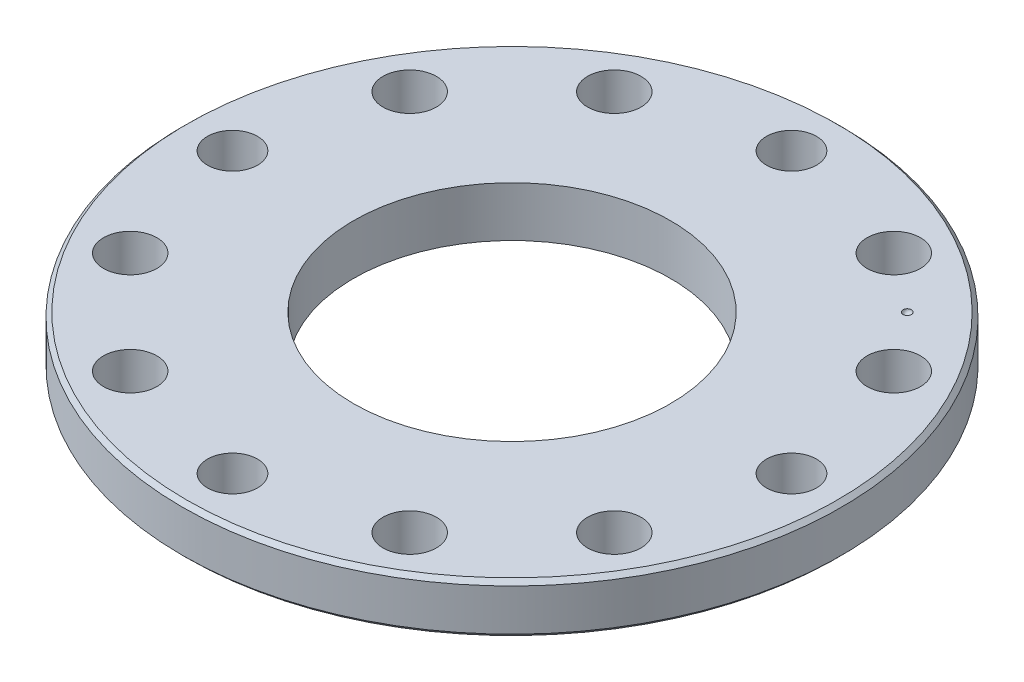
ISO-10303-21;
HEADER;
FILE_DESCRIPTION(('STEP AP214'),'2;1');
FILE_NAME('part.step','',(''),(''),'','','');
FILE_SCHEMA(('AUTOMOTIVE_DESIGN { 1 0 10303 214 1 1 1 1 }'));
ENDSEC;
DATA;
#1=APPLICATION_CONTEXT('core data for automotive mechanical design processes');
#2=APPLICATION_PROTOCOL_DEFINITION('international standard','automotive_design',2000,#1);
#3=PRODUCT_CONTEXT('',#1,'mechanical');
#4=PRODUCT('Part','Part','',(#3));
#5=PRODUCT_RELATED_PRODUCT_CATEGORY('part','',(#4));
#6=PRODUCT_DEFINITION_FORMATION('','',#4);
#7=PRODUCT_DEFINITION_CONTEXT('part definition',#1,'design');
#8=PRODUCT_DEFINITION('design','',#6,#7);
#9=PRODUCT_DEFINITION_SHAPE('','',#8);
#10=(LENGTH_UNIT() NAMED_UNIT(*) SI_UNIT(.MILLI.,.METRE.));
#11=(NAMED_UNIT(*) PLANE_ANGLE_UNIT() SI_UNIT($,.RADIAN.));
#12=(NAMED_UNIT(*) SI_UNIT($,.STERADIAN.) SOLID_ANGLE_UNIT());
#13=UNCERTAINTY_MEASURE_WITH_UNIT(LENGTH_MEASURE(1.E-05),#10,'distance_accuracy_value','');
#14=(GEOMETRIC_REPRESENTATION_CONTEXT(3) GLOBAL_UNCERTAINTY_ASSIGNED_CONTEXT((#13)) GLOBAL_UNIT_ASSIGNED_CONTEXT((#10,
#11,#12)) REPRESENTATION_CONTEXT('',''));
#15=CARTESIAN_POINT('',(0.,0.,0.));
#16=DIRECTION('',(0.,0.,1.));
#17=DIRECTION('',(1.,0.,0.));
#18=AXIS2_PLACEMENT_3D('',#15,#16,#17);
#19=CARTESIAN_POINT('',(0.,-6.,0.));
#20=DIRECTION('',(0.,1.,0.));
#21=DIRECTION('',(0.,0.,1.));
#22=AXIS2_PLACEMENT_3D('',#19,#20,#21);
#23=CYLINDRICAL_SURFACE('',#22,39.5);
#24=CARTESIAN_POINT('',(0.,-0.49999999999998,0.));
#25=DIRECTION('',(0.,1.,0.));
#26=DIRECTION('',(0.,0.,1.));
#27=AXIS2_PLACEMENT_3D('',#24,#25,#26);
#28=CIRCLE('',#27,39.5);
#29=CARTESIAN_POINT('',(0.,-0.49999999999998,39.5));
#30=VERTEX_POINT('',#29);
#31=EDGE_CURVE('E44',#30,#30,#28,.F.);
#32=ORIENTED_EDGE('',*,*,#31,.T.);
#33=EDGE_LOOP('',(#32));
#34=FACE_BOUND('',#33,.T.);
#35=CARTESIAN_POINT('',(0.,-5.49999999999999,0.));
#36=DIRECTION('',(0.,1.,0.));
#37=DIRECTION('',(0.,0.,1.));
#38=AXIS2_PLACEMENT_3D('',#35,#36,#37);
#39=CIRCLE('',#38,39.5);
#40=CARTESIAN_POINT('',(0.,-5.49999999999999,39.5));
#41=VERTEX_POINT('',#40);
#42=EDGE_CURVE('E49',#41,#41,#39,.T.);
#43=ORIENTED_EDGE('',*,*,#42,.T.);
#44=EDGE_LOOP('',(#43));
#45=FACE_BOUND('',#44,.T.);
#46=ADVANCED_FACE('F36',(#34,#45),#23,.T.);
#47=CARTESIAN_POINT('',(0.,-6.,0.));
#48=DIRECTION('',(0.,1.,0.));
#49=DIRECTION('',(0.,0.,1.));
#50=AXIS2_PLACEMENT_3D('',#47,#48,#49);
#51=PLANE('',#50);
#52=CARTESIAN_POINT('',(0.,-6.,0.));
#53=DIRECTION('',(0.,1.,0.));
#54=DIRECTION('',(0.,0.,1.));
#55=AXIS2_PLACEMENT_3D('',#52,#53,#54);
#56=CIRCLE('',#55,39.);
#57=CARTESIAN_POINT('',(0.,-6.,39.));
#58=VERTEX_POINT('',#57);
#59=EDGE_CURVE('E10',#58,#58,#56,.F.);
#60=ORIENTED_EDGE('',*,*,#59,.T.);
#61=EDGE_LOOP('',(#60));
#62=FACE_BOUND('',#61,.T.);
#63=CARTESIAN_POINT('',(-16.75,-6.,29.0118510267787));
#64=DIRECTION('',(0.,1.,0.));
#65=DIRECTION('',(0.,0.,1.));
#66=AXIS2_PLACEMENT_3D('',#63,#64,#65);
#67=CIRCLE('',#66,3.2);
#68=CARTESIAN_POINT('',(-16.75,-6.,32.2118510267787));
#69=VERTEX_POINT('',#68);
#70=EDGE_CURVE('E146',#69,#69,#67,.T.);
#71=ORIENTED_EDGE('',*,*,#70,.T.);
#72=EDGE_LOOP('',(#71));
#73=FACE_BOUND('',#72,.T.);
#74=CARTESIAN_POINT('',(-29.0118510267787,-6.,-16.75));
#75=DIRECTION('',(0.,1.,0.));
#76=DIRECTION('',(0.,0.,1.));
#77=AXIS2_PLACEMENT_3D('',#74,#75,#76);
#78=CIRCLE('',#77,3.2);
#79=CARTESIAN_POINT('',(-29.0118510267787,-6.,-13.55));
#80=VERTEX_POINT('',#79);
#81=EDGE_CURVE('E139',#80,#80,#78,.T.);
#82=ORIENTED_EDGE('',*,*,#81,.T.);
#83=EDGE_LOOP('',(#82));
#84=FACE_BOUND('',#83,.T.);
#85=CARTESIAN_POINT('',(16.75,-6.,-29.0118510267787));
#86=DIRECTION('',(0.,1.,0.));
#87=DIRECTION('',(0.,0.,1.));
#88=AXIS2_PLACEMENT_3D('',#85,#86,#87);
#89=CIRCLE('',#88,3.2);
#90=CARTESIAN_POINT('',(16.75,-6.,-25.8118510267787));
#91=VERTEX_POINT('',#90);
#92=EDGE_CURVE('E132',#91,#91,#89,.T.);
#93=ORIENTED_EDGE('',*,*,#92,.T.);
#94=EDGE_LOOP('',(#93));
#95=FACE_BOUND('',#94,.T.);
#96=CARTESIAN_POINT('',(29.0118510267787,-6.,16.75));
#97=DIRECTION('',(0.,1.,0.));
#98=DIRECTION('',(0.,0.,1.));
#99=AXIS2_PLACEMENT_3D('',#96,#97,#98);
#100=CIRCLE('',#99,3.2);
#101=CARTESIAN_POINT('',(29.0118510267787,-6.,19.95));
#102=VERTEX_POINT('',#101);
#103=EDGE_CURVE('E125',#102,#102,#100,.T.);
#104=ORIENTED_EDGE('',*,*,#103,.T.);
#105=EDGE_LOOP('',(#104));
#106=FACE_BOUND('',#105,.T.);
#107=CARTESIAN_POINT('',(-16.75,-6.,-29.0118510267787));
#108=DIRECTION('',(0.,1.,0.));
#109=DIRECTION('',(0.,0.,1.));
#110=AXIS2_PLACEMENT_3D('',#107,#108,#109);
#111=CIRCLE('',#110,3.2);
#112=CARTESIAN_POINT('',(-16.75,-6.,-25.8118510267787));
#113=VERTEX_POINT('',#112);
#114=EDGE_CURVE('E118',#113,#113,#111,.T.);
#115=ORIENTED_EDGE('',*,*,#114,.T.);
#116=EDGE_LOOP('',(#115));
#117=FACE_BOUND('',#116,.T.);
#118=CARTESIAN_POINT('',(29.0118510267787,-6.,-16.75));
#119=DIRECTION('',(0.,1.,0.));
#120=DIRECTION('',(0.,0.,1.));
#121=AXIS2_PLACEMENT_3D('',#118,#119,#120);
#122=CIRCLE('',#121,3.2);
#123=CARTESIAN_POINT('',(29.0118510267787,-6.,-13.55));
#124=VERTEX_POINT('',#123);
#125=EDGE_CURVE('E112',#124,#124,#122,.T.);
#126=ORIENTED_EDGE('',*,*,#125,.T.);
#127=EDGE_LOOP('',(#126));
#128=FACE_BOUND('',#127,.T.);
#129=CARTESIAN_POINT('',(16.75,-6.,29.0118510267787));
#130=DIRECTION('',(0.,1.,0.));
#131=DIRECTION('',(0.,0.,1.));
#132=AXIS2_PLACEMENT_3D('',#129,#130,#131);
#133=CIRCLE('',#132,3.2);
#134=CARTESIAN_POINT('',(16.75,-6.,32.2118510267787));
#135=VERTEX_POINT('',#134);
#136=EDGE_CURVE('E104',#135,#135,#133,.T.);
#137=ORIENTED_EDGE('',*,*,#136,.T.);
#138=EDGE_LOOP('',(#137));
#139=FACE_BOUND('',#138,.T.);
#140=CARTESIAN_POINT('',(-29.0118510267787,-6.,16.75));
#141=DIRECTION('',(0.,1.,0.));
#142=DIRECTION('',(0.,0.,1.));
#143=AXIS2_PLACEMENT_3D('',#140,#141,#142);
#144=CIRCLE('',#143,3.2);
#145=CARTESIAN_POINT('',(-29.0118510267787,-6.,19.95));
#146=VERTEX_POINT('',#145);
#147=EDGE_CURVE('E93',#146,#146,#144,.T.);
#148=ORIENTED_EDGE('',*,*,#147,.T.);
#149=EDGE_LOOP('',(#148));
#150=FACE_BOUND('',#149,.T.);
#151=CARTESIAN_POINT('',(0.,-6.,33.5));
#152=DIRECTION('',(0.,1.,0.));
#153=DIRECTION('',(0.,0.,1.));
#154=AXIS2_PLACEMENT_3D('',#151,#152,#153);
#155=CIRCLE('',#154,3.00000000000036);
#156=CARTESIAN_POINT('',(0.,-6.,36.5000000000004));
#157=VERTEX_POINT('',#156);
#158=EDGE_CURVE('E85',#157,#157,#155,.T.);
#159=ORIENTED_EDGE('',*,*,#158,.T.);
#160=EDGE_LOOP('',(#159));
#161=FACE_BOUND('',#160,.T.);
#162=CARTESIAN_POINT('',(-33.5,-6.,0.));
#163=DIRECTION('',(0.,1.,0.));
#164=DIRECTION('',(0.,0.,1.));
#165=AXIS2_PLACEMENT_3D('',#162,#163,#164);
#166=CIRCLE('',#165,2.9999999999999);
#167=CARTESIAN_POINT('',(-33.5,-6.,2.9999999999999));
#168=VERTEX_POINT('',#167);
#169=EDGE_CURVE('E78',#168,#168,#166,.T.);
#170=ORIENTED_EDGE('',*,*,#169,.T.);
#171=EDGE_LOOP('',(#170));
#172=FACE_BOUND('',#171,.T.);
#173=CARTESIAN_POINT('',(33.5,-6.,0.));
#174=DIRECTION('',(0.,1.,0.));
#175=DIRECTION('',(0.,0.,1.));
#176=AXIS2_PLACEMENT_3D('',#173,#174,#175);
#177=CIRCLE('',#176,3.00000000000011);
#178=CARTESIAN_POINT('',(33.5,-6.,3.00000000000011));
#179=VERTEX_POINT('',#178);
#180=EDGE_CURVE('E71',#179,#179,#177,.T.);
#181=ORIENTED_EDGE('',*,*,#180,.T.);
#182=EDGE_LOOP('',(#181));
#183=FACE_BOUND('',#182,.T.);
#184=CARTESIAN_POINT('',(0.,-6.,-33.5));
#185=DIRECTION('',(0.,1.,0.));
#186=DIRECTION('',(0.,0.,1.));
#187=AXIS2_PLACEMENT_3D('',#184,#185,#186);
#188=CIRCLE('',#187,2.99999999999964);
#189=CARTESIAN_POINT('',(0.,-6.,-30.5000000000004));
#190=VERTEX_POINT('',#189);
#191=EDGE_CURVE('E64',#190,#190,#188,.T.);
#192=ORIENTED_EDGE('',*,*,#191,.T.);
#193=EDGE_LOOP('',(#192));
#194=FACE_BOUND('',#193,.T.);
#195=CARTESIAN_POINT('',(0.,-6.,0.));
#196=DIRECTION('',(0.,1.,0.));
#197=DIRECTION('',(0.,0.,1.));
#198=AXIS2_PLACEMENT_3D('',#195,#196,#197);
#199=CIRCLE('',#198,19.);
#200=CARTESIAN_POINT('',(0.,-6.,19.));
#201=VERTEX_POINT('',#200);
#202=EDGE_CURVE('E59',#201,#201,#199,.T.);
#203=ORIENTED_EDGE('',*,*,#202,.T.);
#204=EDGE_LOOP('',(#203));
#205=FACE_BOUND('',#204,.T.);
#206=ADVANCED_FACE('F170',(#62,#73,#84,#95,#106,#117,#128,#139,#150,#161,#172,#183,#194,#205),
#51,.F.);
#207=CARTESIAN_POINT('',(0.,0.,0.));
#208=DIRECTION('',(0.,1.,0.));
#209=DIRECTION('',(0.,0.,1.));
#210=AXIS2_PLACEMENT_3D('',#207,#208,#209);
#211=PLANE('',#210);
#212=CARTESIAN_POINT('',(23.6880771697494,0.,-23.6880771697493));
#213=DIRECTION('',(0.,1.,0.));
#214=DIRECTION('',(0.,0.,1.));
#215=AXIS2_PLACEMENT_3D('',#212,#213,#214);
#216=CIRCLE('',#215,0.500000000000001);
#217=CARTESIAN_POINT('',(23.6880771697494,0.,-23.1880771697493));
#218=VERTEX_POINT('',#217);
#219=EDGE_CURVE('E40',#218,#218,#216,.T.);
#220=ORIENTED_EDGE('',*,*,#219,.F.);
#221=EDGE_LOOP('',(#220));
#222=FACE_BOUND('',#221,.T.);
#223=CARTESIAN_POINT('',(0.,0.,0.));
#224=DIRECTION('',(0.,1.,0.));
#225=DIRECTION('',(0.,0.,1.));
#226=AXIS2_PLACEMENT_3D('',#223,#224,#225);
#227=CIRCLE('',#226,39.);
#228=CARTESIAN_POINT('',(0.,0.,39.));
#229=VERTEX_POINT('',#228);
#230=EDGE_CURVE('E55',#229,#229,#227,.T.);
#231=ORIENTED_EDGE('',*,*,#230,.T.);
#232=EDGE_LOOP('',(#231));
#233=FACE_BOUND('',#232,.T.);
#234=CARTESIAN_POINT('',(-16.75,0.,29.0118510267787));
#235=DIRECTION('',(0.,1.,0.));
#236=DIRECTION('',(0.,0.,1.));
#237=AXIS2_PLACEMENT_3D('',#234,#235,#236);
#238=CIRCLE('',#237,3.19999999999999);
#239=CARTESIAN_POINT('',(-16.75,0.,32.2118510267787));
#240=VERTEX_POINT('',#239);
#241=EDGE_CURVE('E150',#240,#240,#238,.T.);
#242=ORIENTED_EDGE('',*,*,#241,.F.);
#243=EDGE_LOOP('',(#242));
#244=FACE_BOUND('',#243,.T.);
#245=CARTESIAN_POINT('',(-29.0118510267787,0.,-16.75));
#246=DIRECTION('',(0.,1.,0.));
#247=DIRECTION('',(0.,0.,1.));
#248=AXIS2_PLACEMENT_3D('',#245,#246,#247);
#249=CIRCLE('',#248,3.19999999999999);
#250=CARTESIAN_POINT('',(-29.0118510267787,0.,-13.55));
#251=VERTEX_POINT('',#250);
#252=EDGE_CURVE('E142',#251,#251,#249,.T.);
#253=ORIENTED_EDGE('',*,*,#252,.F.);
#254=EDGE_LOOP('',(#253));
#255=FACE_BOUND('',#254,.T.);
#256=CARTESIAN_POINT('',(16.75,0.,-29.0118510267787));
#257=DIRECTION('',(0.,1.,0.));
#258=DIRECTION('',(0.,0.,1.));
#259=AXIS2_PLACEMENT_3D('',#256,#257,#258);
#260=CIRCLE('',#259,3.19999999999999);
#261=CARTESIAN_POINT('',(16.75,0.,-25.8118510267787));
#262=VERTEX_POINT('',#261);
#263=EDGE_CURVE('E135',#262,#262,#260,.T.);
#264=ORIENTED_EDGE('',*,*,#263,.F.);
#265=EDGE_LOOP('',(#264));
#266=FACE_BOUND('',#265,.T.);
#267=CARTESIAN_POINT('',(29.0118510267787,0.,16.75));
#268=DIRECTION('',(0.,1.,0.));
#269=DIRECTION('',(0.,0.,1.));
#270=AXIS2_PLACEMENT_3D('',#267,#268,#269);
#271=CIRCLE('',#270,3.19999999999999);
#272=CARTESIAN_POINT('',(29.0118510267787,0.,19.95));
#273=VERTEX_POINT('',#272);
#274=EDGE_CURVE('E128',#273,#273,#271,.T.);
#275=ORIENTED_EDGE('',*,*,#274,.F.);
#276=EDGE_LOOP('',(#275));
#277=FACE_BOUND('',#276,.T.);
#278=CARTESIAN_POINT('',(-16.75,0.,-29.0118510267787));
#279=DIRECTION('',(0.,1.,0.));
#280=DIRECTION('',(0.,0.,1.));
#281=AXIS2_PLACEMENT_3D('',#278,#279,#280);
#282=CIRCLE('',#281,3.19999999999999);
#283=CARTESIAN_POINT('',(-16.75,0.,-25.8118510267787));
#284=VERTEX_POINT('',#283);
#285=EDGE_CURVE('E121',#284,#284,#282,.T.);
#286=ORIENTED_EDGE('',*,*,#285,.F.);
#287=EDGE_LOOP('',(#286));
#288=FACE_BOUND('',#287,.T.);
#289=CARTESIAN_POINT('',(29.0118510267787,0.,-16.75));
#290=DIRECTION('',(0.,1.,0.));
#291=DIRECTION('',(0.,0.,1.));
#292=AXIS2_PLACEMENT_3D('',#289,#290,#291);
#293=CIRCLE('',#292,3.19999999999998);
#294=CARTESIAN_POINT('',(29.0118510267787,0.,-13.55));
#295=VERTEX_POINT('',#294);
#296=EDGE_CURVE('E115',#295,#295,#293,.T.);
#297=ORIENTED_EDGE('',*,*,#296,.F.);
#298=EDGE_LOOP('',(#297));
#299=FACE_BOUND('',#298,.T.);
#300=CARTESIAN_POINT('',(16.75,0.,29.0118510267787));
#301=DIRECTION('',(0.,1.,0.));
#302=DIRECTION('',(0.,0.,1.));
#303=AXIS2_PLACEMENT_3D('',#300,#301,#302);
#304=CIRCLE('',#303,3.19999999999999);
#305=CARTESIAN_POINT('',(16.75,0.,32.2118510267787));
#306=VERTEX_POINT('',#305);
#307=EDGE_CURVE('E108',#306,#306,#304,.T.);
#308=ORIENTED_EDGE('',*,*,#307,.F.);
#309=EDGE_LOOP('',(#308));
#310=FACE_BOUND('',#309,.T.);
#311=CARTESIAN_POINT('',(-29.0118510267787,0.,16.75));
#312=DIRECTION('',(0.,1.,0.));
#313=DIRECTION('',(0.,0.,1.));
#314=AXIS2_PLACEMENT_3D('',#311,#312,#313);
#315=CIRCLE('',#314,3.19999999999999);
#316=CARTESIAN_POINT('',(-29.0118510267787,0.,19.95));
#317=VERTEX_POINT('',#316);
#318=EDGE_CURVE('E100',#317,#317,#315,.T.);
#319=ORIENTED_EDGE('',*,*,#318,.F.);
#320=EDGE_LOOP('',(#319));
#321=FACE_BOUND('',#320,.T.);
#322=CARTESIAN_POINT('',(0.,0.,33.5));
#323=DIRECTION('',(0.,1.,0.));
#324=DIRECTION('',(0.,0.,1.));
#325=AXIS2_PLACEMENT_3D('',#322,#323,#324);
#326=CIRCLE('',#325,3.00000000000036);
#327=CARTESIAN_POINT('',(0.,0.,36.5000000000004));
#328=VERTEX_POINT('',#327);
#329=EDGE_CURVE('E89',#328,#328,#326,.T.);
#330=ORIENTED_EDGE('',*,*,#329,.F.);
#331=EDGE_LOOP('',(#330));
#332=FACE_BOUND('',#331,.T.);
#333=CARTESIAN_POINT('',(-33.5,0.,0.));
#334=DIRECTION('',(0.,1.,0.));
#335=DIRECTION('',(0.,0.,1.));
#336=AXIS2_PLACEMENT_3D('',#333,#334,#335);
#337=CIRCLE('',#336,2.9999999999999);
#338=CARTESIAN_POINT('',(-33.5,0.,2.9999999999999));
#339=VERTEX_POINT('',#338);
#340=EDGE_CURVE('E81',#339,#339,#337,.T.);
#341=ORIENTED_EDGE('',*,*,#340,.F.);
#342=EDGE_LOOP('',(#341));
#343=FACE_BOUND('',#342,.T.);
#344=CARTESIAN_POINT('',(33.5,0.,0.));
#345=DIRECTION('',(0.,1.,0.));
#346=DIRECTION('',(0.,0.,1.));
#347=AXIS2_PLACEMENT_3D('',#344,#345,#346);
#348=CIRCLE('',#347,3.00000000000011);
#349=CARTESIAN_POINT('',(33.5,0.,3.00000000000011));
#350=VERTEX_POINT('',#349);
#351=EDGE_CURVE('E74',#350,#350,#348,.T.);
#352=ORIENTED_EDGE('',*,*,#351,.F.);
#353=EDGE_LOOP('',(#352));
#354=FACE_BOUND('',#353,.T.);
#355=CARTESIAN_POINT('',(0.,0.,-33.5));
#356=DIRECTION('',(0.,1.,0.));
#357=DIRECTION('',(0.,0.,1.));
#358=AXIS2_PLACEMENT_3D('',#355,#356,#357);
#359=CIRCLE('',#358,2.99999999999964);
#360=CARTESIAN_POINT('',(0.,0.,-30.5000000000004));
#361=VERTEX_POINT('',#360);
#362=EDGE_CURVE('E67',#361,#361,#359,.T.);
#363=ORIENTED_EDGE('',*,*,#362,.F.);
#364=EDGE_LOOP('',(#363));
#365=FACE_BOUND('',#364,.T.);
#366=CARTESIAN_POINT('',(0.,0.,0.));
#367=DIRECTION('',(0.,1.,0.));
#368=DIRECTION('',(0.,0.,1.));
#369=AXIS2_PLACEMENT_3D('',#366,#367,#368);
#370=CIRCLE('',#369,19.);
#371=CARTESIAN_POINT('',(0.,0.,19.));
#372=VERTEX_POINT('',#371);
#373=EDGE_CURVE('E60',#372,#372,#370,.T.);
#374=ORIENTED_EDGE('',*,*,#373,.F.);
#375=EDGE_LOOP('',(#374));
#376=FACE_BOUND('',#375,.T.);
#377=ADVANCED_FACE('F166',(#222,#233,#244,#255,#266,#277,#288,#299,#310,#321,#332,#343,#354,
#365,#376),#211,.T.);
#378=CARTESIAN_POINT('',(0.,-6.,0.));
#379=DIRECTION('',(0.,1.,0.));
#380=DIRECTION('',(0.,0.,1.));
#381=AXIS2_PLACEMENT_3D('',#378,#379,#380);
#382=CYLINDRICAL_SURFACE('',#381,19.);
#383=ORIENTED_EDGE('',*,*,#202,.F.);
#384=EDGE_LOOP('',(#383));
#385=FACE_BOUND('',#384,.T.);
#386=ORIENTED_EDGE('',*,*,#373,.T.);
#387=EDGE_LOOP('',(#386));
#388=FACE_BOUND('',#387,.T.);
#389=ADVANCED_FACE('F169',(#385,#388),#382,.F.);
#390=CARTESIAN_POINT('',(0.,-6.,-33.5));
#391=DIRECTION('',(0.,1.,0.));
#392=DIRECTION('',(0.,0.,1.));
#393=AXIS2_PLACEMENT_3D('',#390,#391,#392);
#394=CYLINDRICAL_SURFACE('',#393,2.99999999999964);
#395=ORIENTED_EDGE('',*,*,#191,.F.);
#396=EDGE_LOOP('',(#395));
#397=FACE_BOUND('',#396,.T.);
#398=ORIENTED_EDGE('',*,*,#362,.T.);
#399=EDGE_LOOP('',(#398));
#400=FACE_BOUND('',#399,.T.);
#401=ADVANCED_FACE('F200',(#397,#400),#394,.F.);
#402=CARTESIAN_POINT('',(33.5,-6.,0.));
#403=DIRECTION('',(0.,1.,0.));
#404=DIRECTION('',(0.,0.,1.));
#405=AXIS2_PLACEMENT_3D('',#402,#403,#404);
#406=CYLINDRICAL_SURFACE('',#405,3.00000000000011);
#407=ORIENTED_EDGE('',*,*,#180,.F.);
#408=EDGE_LOOP('',(#407));
#409=FACE_BOUND('',#408,.T.);
#410=ORIENTED_EDGE('',*,*,#351,.T.);
#411=EDGE_LOOP('',(#410));
#412=FACE_BOUND('',#411,.T.);
#413=ADVANCED_FACE('F206',(#409,#412),#406,.F.);
#414=CARTESIAN_POINT('',(-33.5,-6.,0.));
#415=DIRECTION('',(0.,1.,0.));
#416=DIRECTION('',(0.,0.,1.));
#417=AXIS2_PLACEMENT_3D('',#414,#415,#416);
#418=CYLINDRICAL_SURFACE('',#417,2.9999999999999);
#419=ORIENTED_EDGE('',*,*,#169,.F.);
#420=EDGE_LOOP('',(#419));
#421=FACE_BOUND('',#420,.T.);
#422=ORIENTED_EDGE('',*,*,#340,.T.);
#423=EDGE_LOOP('',(#422));
#424=FACE_BOUND('',#423,.T.);
#425=ADVANCED_FACE('F266',(#421,#424),#418,.F.);
#426=CARTESIAN_POINT('',(0.,-6.,33.5));
#427=DIRECTION('',(0.,1.,0.));
#428=DIRECTION('',(0.,0.,1.));
#429=AXIS2_PLACEMENT_3D('',#426,#427,#428);
#430=CYLINDRICAL_SURFACE('',#429,3.00000000000036);
#431=ORIENTED_EDGE('',*,*,#158,.F.);
#432=EDGE_LOOP('',(#431));
#433=FACE_BOUND('',#432,.T.);
#434=ORIENTED_EDGE('',*,*,#329,.T.);
#435=EDGE_LOOP('',(#434));
#436=FACE_BOUND('',#435,.T.);
#437=ADVANCED_FACE('F262',(#433,#436),#430,.F.);
#438=CARTESIAN_POINT('',(-29.0118510267787,0.,16.75));
#439=DIRECTION('',(0.,1.,0.));
#440=DIRECTION('',(0.,0.,1.));
#441=AXIS2_PLACEMENT_3D('',#438,#439,#440);
#442=CYLINDRICAL_SURFACE('',#441,3.19999999999999);
#443=ORIENTED_EDGE('',*,*,#147,.F.);
#444=EDGE_LOOP('',(#443));
#445=FACE_BOUND('',#444,.T.);
#446=ORIENTED_EDGE('',*,*,#318,.T.);
#447=EDGE_LOOP('',(#446));
#448=FACE_BOUND('',#447,.T.);
#449=ADVANCED_FACE('F258',(#445,#448),#442,.F.);
#450=CARTESIAN_POINT('',(16.75,0.,29.0118510267787));
#451=DIRECTION('',(0.,1.,0.));
#452=DIRECTION('',(0.,0.,1.));
#453=AXIS2_PLACEMENT_3D('',#450,#451,#452);
#454=CYLINDRICAL_SURFACE('',#453,3.19999999999999);
#455=ORIENTED_EDGE('',*,*,#136,.F.);
#456=EDGE_LOOP('',(#455));
#457=FACE_BOUND('',#456,.T.);
#458=ORIENTED_EDGE('',*,*,#307,.T.);
#459=EDGE_LOOP('',(#458));
#460=FACE_BOUND('',#459,.T.);
#461=ADVANCED_FACE('F254',(#457,#460),#454,.F.);
#462=CARTESIAN_POINT('',(29.0118510267787,0.,-16.75));
#463=DIRECTION('',(0.,1.,0.));
#464=DIRECTION('',(0.,0.,1.));
#465=AXIS2_PLACEMENT_3D('',#462,#463,#464);
#466=CYLINDRICAL_SURFACE('',#465,3.19999999999999);
#467=ORIENTED_EDGE('',*,*,#125,.F.);
#468=EDGE_LOOP('',(#467));
#469=FACE_BOUND('',#468,.T.);
#470=ORIENTED_EDGE('',*,*,#296,.T.);
#471=EDGE_LOOP('',(#470));
#472=FACE_BOUND('',#471,.T.);
#473=ADVANCED_FACE('F250',(#469,#472),#466,.F.);
#474=CARTESIAN_POINT('',(-16.75,0.,-29.0118510267787));
#475=DIRECTION('',(0.,1.,0.));
#476=DIRECTION('',(0.,0.,1.));
#477=AXIS2_PLACEMENT_3D('',#474,#475,#476);
#478=CYLINDRICAL_SURFACE('',#477,3.19999999999999);
#479=ORIENTED_EDGE('',*,*,#114,.F.);
#480=EDGE_LOOP('',(#479));
#481=FACE_BOUND('',#480,.T.);
#482=ORIENTED_EDGE('',*,*,#285,.T.);
#483=EDGE_LOOP('',(#482));
#484=FACE_BOUND('',#483,.T.);
#485=ADVANCED_FACE('F246',(#481,#484),#478,.F.);
#486=CARTESIAN_POINT('',(29.0118510267787,0.,16.75));
#487=DIRECTION('',(0.,1.,0.));
#488=DIRECTION('',(0.,0.,1.));
#489=AXIS2_PLACEMENT_3D('',#486,#487,#488);
#490=CYLINDRICAL_SURFACE('',#489,3.19999999999999);
#491=ORIENTED_EDGE('',*,*,#103,.F.);
#492=EDGE_LOOP('',(#491));
#493=FACE_BOUND('',#492,.T.);
#494=ORIENTED_EDGE('',*,*,#274,.T.);
#495=EDGE_LOOP('',(#494));
#496=FACE_BOUND('',#495,.T.);
#497=ADVANCED_FACE('F242',(#493,#496),#490,.F.);
#498=CARTESIAN_POINT('',(16.75,0.,-29.0118510267787));
#499=DIRECTION('',(0.,1.,0.));
#500=DIRECTION('',(0.,0.,1.));
#501=AXIS2_PLACEMENT_3D('',#498,#499,#500);
#502=CYLINDRICAL_SURFACE('',#501,3.19999999999999);
#503=ORIENTED_EDGE('',*,*,#92,.F.);
#504=EDGE_LOOP('',(#503));
#505=FACE_BOUND('',#504,.T.);
#506=ORIENTED_EDGE('',*,*,#263,.T.);
#507=EDGE_LOOP('',(#506));
#508=FACE_BOUND('',#507,.T.);
#509=ADVANCED_FACE('F234',(#505,#508),#502,.F.);
#510=CARTESIAN_POINT('',(-29.0118510267787,0.,-16.75));
#511=DIRECTION('',(0.,1.,0.));
#512=DIRECTION('',(0.,0.,1.));
#513=AXIS2_PLACEMENT_3D('',#510,#511,#512);
#514=CYLINDRICAL_SURFACE('',#513,3.19999999999999);
#515=ORIENTED_EDGE('',*,*,#81,.F.);
#516=EDGE_LOOP('',(#515));
#517=FACE_BOUND('',#516,.T.);
#518=ORIENTED_EDGE('',*,*,#252,.T.);
#519=EDGE_LOOP('',(#518));
#520=FACE_BOUND('',#519,.T.);
#521=ADVANCED_FACE('F226',(#517,#520),#514,.F.);
#522=CARTESIAN_POINT('',(-16.75,0.,29.0118510267787));
#523=DIRECTION('',(0.,1.,0.));
#524=DIRECTION('',(0.,0.,1.));
#525=AXIS2_PLACEMENT_3D('',#522,#523,#524);
#526=CYLINDRICAL_SURFACE('',#525,3.19999999999999);
#527=ORIENTED_EDGE('',*,*,#70,.F.);
#528=EDGE_LOOP('',(#527));
#529=FACE_BOUND('',#528,.T.);
#530=ORIENTED_EDGE('',*,*,#241,.T.);
#531=EDGE_LOOP('',(#530));
#532=FACE_BOUND('',#531,.T.);
#533=ADVANCED_FACE('F219',(#529,#532),#526,.F.);
#534=CARTESIAN_POINT('',(0.,0.,0.));
#535=DIRECTION('',(0.,-1.,0.));
#536=DIRECTION('',(0.,0.,-1.));
#537=AXIS2_PLACEMENT_3D('',#534,#535,#536);
#538=CONICAL_SURFACE('',#537,39.,0.785398163397448);
#539=ORIENTED_EDGE('',*,*,#31,.F.);
#540=EDGE_LOOP('',(#539));
#541=FACE_BOUND('',#540,.T.);
#542=ORIENTED_EDGE('',*,*,#230,.F.);
#543=EDGE_LOOP('',(#542));
#544=FACE_BOUND('',#543,.T.);
#545=ADVANCED_FACE('F217',(#541,#544),#538,.T.);
#546=CARTESIAN_POINT('',(0.,-5.49999999999999,0.));
#547=DIRECTION('',(0.,1.,0.));
#548=DIRECTION('',(0.,0.,1.));
#549=AXIS2_PLACEMENT_3D('',#546,#547,#548);
#550=CONICAL_SURFACE('',#549,39.5,0.785398163397448);
#551=ORIENTED_EDGE('',*,*,#59,.F.);
#552=EDGE_LOOP('',(#551));
#553=FACE_BOUND('',#552,.T.);
#554=ORIENTED_EDGE('',*,*,#42,.F.);
#555=EDGE_LOOP('',(#554));
#556=FACE_BOUND('',#555,.T.);
#557=ADVANCED_FACE('F38',(#553,#556),#550,.T.);
#558=CARTESIAN_POINT('',(23.6880771697494,0.,-23.6880771697493));
#559=DIRECTION('',(0.707106781186549,0.,-0.707106781186546));
#560=DIRECTION('',(-0.707106781186546,0.,-0.707106781186549));
#561=AXIS2_PLACEMENT_3D('',#558,#559,#560);
#562=SPHERICAL_SURFACE('',#561,0.500000000000001);
#563=CARTESIAN_POINT('',(23.6880771697494,0.,-23.6880771697493));
#564=DIRECTION('',(0.,1.,0.));
#565=DIRECTION('',(0.,0.,1.));
#566=AXIS2_PLACEMENT_3D('',#563,#564,#565);
#567=SPHERICAL_SURFACE('',#566,0.500000000000001);
#568=ORIENTED_EDGE('',*,*,#219,.T.);
#569=EDGE_LOOP('',(#568));
#570=FACE_BOUND('',#569,.T.);
#571=ADVANCED_FACE('F164',(#570),#567,.F.);
#572=CLOSED_SHELL('',(#46,#206,#377,#389,#401,#413,#425,#437,#449,#461,#473,#485,#497,#509,#521,
#533,#545,#557,#571));
#573=MANIFOLD_SOLID_BREP('B2',#572);
#574=ADVANCED_BREP_SHAPE_REPRESENTATION('',(#18,#573),#14);
#575=SHAPE_DEFINITION_REPRESENTATION(#9,#574);
ENDSEC;
END-ISO-10303-21;
